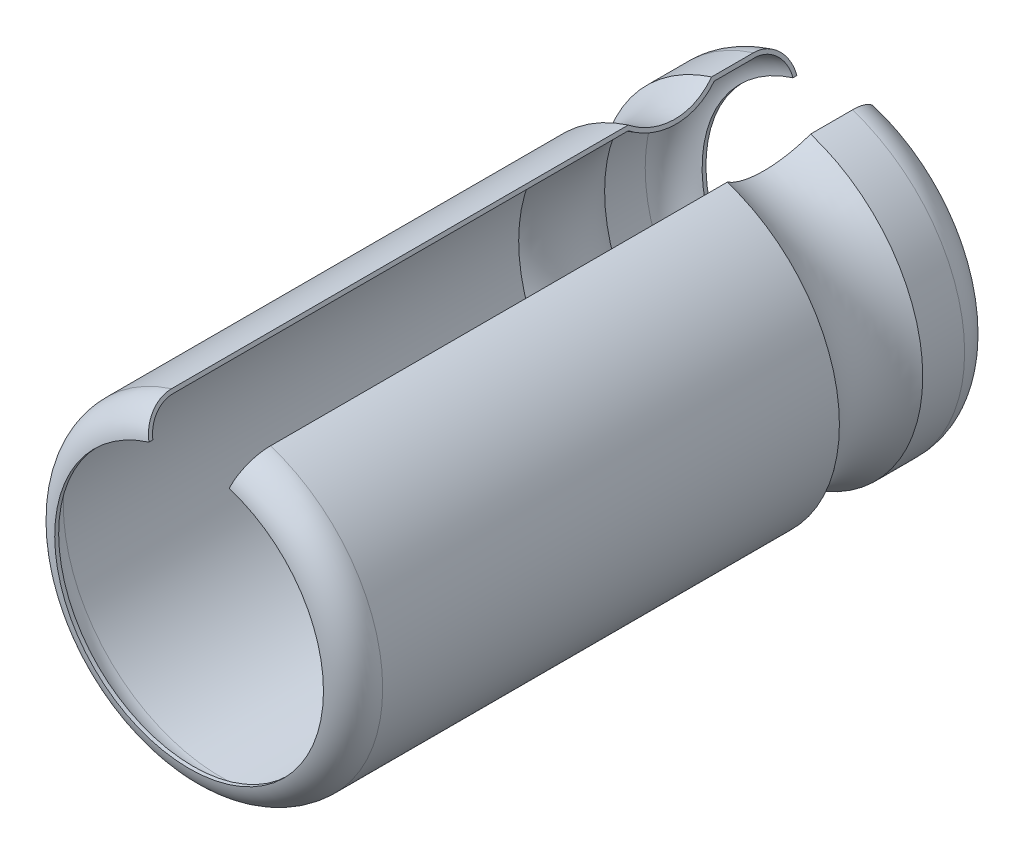
ISO-10303-21;
HEADER;
FILE_DESCRIPTION(('STEP AP214'),'2;1');
FILE_NAME('part.step','',(''),(''),'','','');
FILE_SCHEMA(('AUTOMOTIVE_DESIGN { 1 0 10303 214 1 1 1 1 }'));
ENDSEC;
DATA;
#1=APPLICATION_CONTEXT('core data for automotive mechanical design processes');
#2=APPLICATION_PROTOCOL_DEFINITION('international standard','automotive_design',2000,#1);
#3=PRODUCT_CONTEXT('',#1,'mechanical');
#4=PRODUCT('Part','Part','',(#3));
#5=PRODUCT_RELATED_PRODUCT_CATEGORY('part','',(#4));
#6=PRODUCT_DEFINITION_FORMATION('','',#4);
#7=PRODUCT_DEFINITION_CONTEXT('part definition',#1,'design');
#8=PRODUCT_DEFINITION('design','',#6,#7);
#9=PRODUCT_DEFINITION_SHAPE('','',#8);
#10=(LENGTH_UNIT() NAMED_UNIT(*) SI_UNIT(.MILLI.,.METRE.));
#11=(NAMED_UNIT(*) PLANE_ANGLE_UNIT() SI_UNIT($,.RADIAN.));
#12=(NAMED_UNIT(*) SI_UNIT($,.STERADIAN.) SOLID_ANGLE_UNIT());
#13=UNCERTAINTY_MEASURE_WITH_UNIT(LENGTH_MEASURE(1.E-05),#10,'distance_accuracy_value','');
#14=(GEOMETRIC_REPRESENTATION_CONTEXT(3) GLOBAL_UNCERTAINTY_ASSIGNED_CONTEXT((#13)) GLOBAL_UNIT_ASSIGNED_CONTEXT((#10,
#11,#12)) REPRESENTATION_CONTEXT('',''));
#15=CARTESIAN_POINT('',(0.,0.,0.));
#16=DIRECTION('',(0.,0.,1.));
#17=DIRECTION('',(1.,0.,0.));
#18=AXIS2_PLACEMENT_3D('',#15,#16,#17);
#19=CARTESIAN_POINT('',(-205.237767720353,-97.447783979241,-9.00000000000008));
#20=DIRECTION('',(0.,0.,-1.));
#21=DIRECTION('',(-1.,0.,0.));
#22=AXIS2_PLACEMENT_3D('',#19,#20,#21);
#23=TOROIDAL_SURFACE('',#22,3.9999999999999,0.880000000000012);
#24=CARTESIAN_POINT('',(-204.049411116396,-93.6283849974859,-9.88000000000009));
#25=CARTESIAN_POINT('',(-204.03245047556,-93.5817860197691,-9.88004198714158));
#26=CARTESIAN_POINT('',(-204.015493927163,-93.5351982859351,-9.8758202195455));
#27=CARTESIAN_POINT('',(-203.982072550367,-93.4433738078617,-9.8591561997904));
#28=CARTESIAN_POINT('',(-203.965607363847,-93.3981360796913,-9.84672009542887));
#29=CARTESIAN_POINT('',(-203.933617492738,-93.3102446311675,-9.81392539837095));
#30=CARTESIAN_POINT('',(-203.918093282006,-93.2675922127282,-9.79356285174915));
#31=CARTESIAN_POINT('',(-203.888438098273,-93.1861152650512,-9.74550819099352));
#32=CARTESIAN_POINT('',(-203.874306863684,-93.1472900171074,-9.71781745663625));
#33=CARTESIAN_POINT('',(-203.847845486058,-93.0745879795935,-9.65590540741109));
#34=CARTESIAN_POINT('',(-203.835514205508,-93.0407080647292,-9.62168824885637));
#35=CARTESIAN_POINT('',(-203.812991022079,-92.9788261268451,-9.54767389860997));
#36=CARTESIAN_POINT('',(-203.802799536708,-92.950825250916,-9.50787562047809));
#37=CARTESIAN_POINT('',(-203.784856280772,-92.9015265603998,-9.42386934338579));
#38=CARTESIAN_POINT('',(-203.777102849111,-92.8802241819899,-9.37966437395536));
#39=CARTESIAN_POINT('',(-203.764250272756,-92.8449120186709,-9.28808313164655));
#40=CARTESIAN_POINT('',(-203.759149542789,-92.8308978782655,-9.24070877196635));
#41=CARTESIAN_POINT('',(-203.753023696497,-92.8140672539013,-9.16086707367844));
#42=CARTESIAN_POINT('',(-203.751199330487,-92.8090548494851,-9.12890446727889));
#43=CARTESIAN_POINT('',(-203.748765551823,-92.8023680975612,-9.06463239991749));
#44=CARTESIAN_POINT('',(-203.748154414107,-92.8006890104878,-9.03232349720697));
#45=CARTESIAN_POINT('',(-203.748155797626,-92.800692811675,-9.00000000000009));
#46=B_SPLINE_CURVE_WITH_KNOTS('',3,(#24,#25,#26,#27,#28,#29,#30,#31,#32,#33,#34,#35,#36,#37,#38,
#39,#40,#41,#42,#43,#44,#45),.UNSPECIFIED.,.F.,.F.,(4,2,2,2,2,2,2,2,2,2,4),(0.,0.14857231243137,
0.297033555747823,0.445568950674934,0.594076398716195,0.742489584586696,0.890931701293249,
1.03927246112343,1.18752446943214,1.28455525229134,1.38144797025738),.UNSPECIFIED.);
#47=CARTESIAN_POINT('',(-204.049411116396,-93.6283849974859,-9.88000000000009));
#48=VERTEX_POINT('',#47);
#49=CARTESIAN_POINT('',(-203.748155797626,-92.800692811675,-9.00000000000009));
#50=VERTEX_POINT('',#49);
#51=EDGE_CURVE('E120',#48,#50,#46,.T.);
#52=ORIENTED_EDGE('',*,*,#51,.F.);
#53=CARTESIAN_POINT('',(-205.237767720353,-97.4477839792411,-9.88000000000009));
#54=DIRECTION('',(0.,0.,-1.));
#55=DIRECTION('',(-1.,0.,0.));
#56=AXIS2_PLACEMENT_3D('',#53,#54,#55);
#57=CIRCLE('',#56,4.00000000000003);
#58=CARTESIAN_POINT('',(-206.426124324694,-93.6283849976054,-9.88000000000009));
#59=VERTEX_POINT('',#58);
#60=EDGE_CURVE('E119',#48,#59,#57,.T.);
#61=ORIENTED_EDGE('',*,*,#60,.T.);
#62=CARTESIAN_POINT('',(-206.727379643462,-92.8006928117976,-9.0000000000001));
#63=CARTESIAN_POINT('',(-206.727394069039,-92.8006531778515,-9.04947868093799));
#64=CARTESIAN_POINT('',(-206.725952191707,-92.8046147032607,-9.09894461511821));
#65=CARTESIAN_POINT('',(-206.720262353567,-92.8202474050716,-9.19643807897552));
#66=CARTESIAN_POINT('',(-206.716016647702,-92.8319123860669,-9.24446673214794));
#67=CARTESIAN_POINT('',(-206.704822708036,-92.8626674825325,-9.33777874070551));
#68=CARTESIAN_POINT('',(-206.697873193657,-92.8817611163654,-9.3830607834753));
#69=CARTESIAN_POINT('',(-206.681475554512,-92.9268132596475,-9.46956518289869));
#70=CARTESIAN_POINT('',(-206.672027856966,-92.9527705953233,-9.510788232035));
#71=CARTESIAN_POINT('',(-206.650897903719,-93.0108246647429,-9.58802659272401));
#72=CARTESIAN_POINT('',(-206.6392150101,-93.0429231511553,-9.6240404124109));
#73=CARTESIAN_POINT('',(-206.613945826119,-93.1123496635517,-9.68983436577946));
#74=CARTESIAN_POINT('',(-206.600359163969,-93.1496787110133,-9.71961327900446));
#75=CARTESIAN_POINT('',(-206.571658589272,-93.2285328919193,-9.77211119200505));
#76=CARTESIAN_POINT('',(-206.556543281909,-93.2700618575878,-9.79482366555942));
#77=CARTESIAN_POINT('',(-206.52522674012,-93.3561033490081,-9.83250277302531));
#78=CARTESIAN_POINT('',(-206.509026129625,-93.4006141605258,-9.84747381497146));
#79=CARTESIAN_POINT('',(-206.481627387724,-93.4758915852201,-9.8655567164391));
#80=CARTESIAN_POINT('',(-206.470600456728,-93.5061878291372,-9.87096983662315));
#81=CARTESIAN_POINT('',(-206.448425312545,-93.5671135370525,-9.87819102038921));
#82=CARTESIAN_POINT('',(-206.437277294599,-93.5977424646308,-9.88000421070748));
#83=CARTESIAN_POINT('',(-206.426124324694,-93.6283849976054,-9.88000000000009));
#84=B_SPLINE_CURVE_WITH_KNOTS('',3,(#62,#63,#64,#65,#66,#67,#68,#69,#70,#71,#72,#73,#74,#75,#76,
#77,#78,#79,#80,#81,#82,#83),.UNSPECIFIED.,.F.,.F.,(4,2,2,2,2,2,2,2,2,2,4),(0.,
0.148238465777582,0.296357857603846,0.444547487387526,0.592711791383805,0.740918444341886,
0.889154081061064,1.0375262174085,1.18581377615464,1.28370199685205,1.38145071258297),.UNSPECIFIED.);
#85=CARTESIAN_POINT('',(-206.727379643462,-92.8006928117976,-9.0000000000001));
#86=VERTEX_POINT('',#85);
#87=EDGE_CURVE('E30',#86,#59,#84,.T.);
#88=ORIENTED_EDGE('',*,*,#87,.F.);
#89=CARTESIAN_POINT('',(-205.237767720353,-97.4477839792411,-9.0000000000001));
#90=DIRECTION('',(0.,0.,1.));
#91=DIRECTION('',(1.,0.,0.));
#92=AXIS2_PLACEMENT_3D('',#89,#90,#91);
#93=CIRCLE('',#92,4.88000000000005);
#94=EDGE_CURVE('E111',#86,#50,#93,.T.);
#95=ORIENTED_EDGE('',*,*,#94,.T.);
#96=EDGE_LOOP('',(#52,#61,#88,#95));
#97=FACE_BOUND('',#96,.T.);
#98=ADVANCED_FACE('F25',(#97),#23,.F.);
#99=CARTESIAN_POINT('',(-205.237767720353,-97.4477839792411,-10.0000000000001));
#100=DIRECTION('',(0.,0.,-1.));
#101=DIRECTION('',(-1.,0.,0.));
#102=AXIS2_PLACEMENT_3D('',#99,#100,#101);
#103=CYLINDRICAL_SURFACE('',#102,4.00000000000003);
#104=ORIENTED_EDGE('',*,*,#60,.F.);
#105=DIRECTION('',(0.,0.,-1.));
#106=VECTOR('',#105,1.);
#107=CARTESIAN_POINT('',(-204.049411116396,-93.628384997486,-10.0000000000001));
#108=LINE('',#107,#106);
#109=CARTESIAN_POINT('',(-204.049411116396,-93.6283849974859,-10.0000000000001));
#110=VERTEX_POINT('',#109);
#111=EDGE_CURVE('E136',#110,#48,#108,.F.);
#112=ORIENTED_EDGE('',*,*,#111,.F.);
#113=CARTESIAN_POINT('',(-205.237767720353,-97.4477839792411,-10.0000000000001));
#114=DIRECTION('',(0.,0.,1.));
#115=DIRECTION('',(1.,0.,0.));
#116=AXIS2_PLACEMENT_3D('',#113,#114,#115);
#117=CIRCLE('',#116,4.00000000000003);
#118=CARTESIAN_POINT('',(-206.426124324694,-93.6283849976054,-10.0000000000001));
#119=VERTEX_POINT('',#118);
#120=EDGE_CURVE('E212',#119,#110,#117,.T.);
#121=ORIENTED_EDGE('',*,*,#120,.F.);
#122=DIRECTION('',(0.,0.,-1.));
#123=VECTOR('',#122,1.);
#124=CARTESIAN_POINT('',(-206.426124324694,-93.6283849976054,-10.0000000000001));
#125=LINE('',#124,#123);
#126=EDGE_CURVE('E131',#59,#119,#125,.T.);
#127=ORIENTED_EDGE('',*,*,#126,.F.);
#128=EDGE_LOOP('',(#104,#112,#121,#127));
#129=FACE_BOUND('',#128,.T.);
#130=ADVANCED_FACE('F225',(#129),#103,.F.);
#131=CARTESIAN_POINT('',(-205.237767720353,-97.4477839792411,-8.35236999988217));
#132=DIRECTION('',(0.,0.,1.));
#133=DIRECTION('',(1.,0.,0.));
#134=AXIS2_PLACEMENT_3D('',#131,#132,#133);
#135=CYLINDRICAL_SURFACE('',#134,4.88000000000005);
#136=ORIENTED_EDGE('',*,*,#94,.F.);
#137=DIRECTION('',(0.,0.,1.));
#138=VECTOR('',#137,1.);
#139=CARTESIAN_POINT('',(-206.727379643462,-92.8006928117975,-8.35236999988217));
#140=LINE('',#139,#138);
#141=CARTESIAN_POINT('',(-206.727379643462,-92.8006928117975,-7.74504137363977));
#142=VERTEX_POINT('',#141);
#143=EDGE_CURVE('E99',#142,#86,#140,.F.);
#144=ORIENTED_EDGE('',*,*,#143,.F.);
#145=CARTESIAN_POINT('',(-205.237767720353,-97.4477839792411,-7.74504137363979));
#146=DIRECTION('',(0.,0.,-1.));
#147=DIRECTION('',(-1.,0.,0.));
#148=AXIS2_PLACEMENT_3D('',#145,#146,#147);
#149=CIRCLE('',#148,4.88000000000008);
#150=CARTESIAN_POINT('',(-203.748155797626,-92.800692811675,-7.74504137363977));
#151=VERTEX_POINT('',#150);
#152=EDGE_CURVE('E239',#151,#142,#149,.T.);
#153=ORIENTED_EDGE('',*,*,#152,.F.);
#154=DIRECTION('',(0.,0.,1.));
#155=VECTOR('',#154,1.);
#156=CARTESIAN_POINT('',(-203.748155797626,-92.800692811675,-8.35236999988217));
#157=LINE('',#156,#155);
#158=EDGE_CURVE('E112',#50,#151,#157,.T.);
#159=ORIENTED_EDGE('',*,*,#158,.F.);
#160=EDGE_LOOP('',(#136,#144,#153,#159));
#161=FACE_BOUND('',#160,.T.);
#162=ADVANCED_FACE('F122',(#161),#135,.F.);
#163=CARTESIAN_POINT('',(-205.237767720353,-97.4477839792411,-9.00000000000008));
#164=DIRECTION('',(0.,0.,-1.));
#165=DIRECTION('',(-1.,0.,0.));
#166=AXIS2_PLACEMENT_3D('',#163,#164,#165);
#167=TOROIDAL_SURFACE('',#166,4.0000000000001,1.);
#168=CARTESIAN_POINT('',(-206.768452334568,-92.6878465204285,-9.0000000000001));
#169=CARTESIAN_POINT('',(-206.768452273509,-92.6878466881845,-9.02811912623945));
#170=CARTESIAN_POINT('',(-206.768046142166,-92.6889625248804,-9.05622477709785));
#171=CARTESIAN_POINT('',(-206.766425939005,-92.6934139964801,-9.11223486527839));
#172=CARTESIAN_POINT('',(-206.765211906891,-92.6967495223004,-9.1401393124203));
#173=CARTESIAN_POINT('',(-206.760369585755,-92.7100536902793,-9.22320123051986));
#174=CARTESIAN_POINT('',(-206.755541039402,-92.7233200123518,-9.27780216606445));
#175=CARTESIAN_POINT('',(-206.742817617801,-92.7582773258991,-9.38385708626218));
#176=CARTESIAN_POINT('',(-206.734921288312,-92.7799723128663,-9.43530956502344));
#177=CARTESIAN_POINT('',(-206.71628787774,-92.8311671876609,-9.53360833823916));
#178=CARTESIAN_POINT('',(-206.705551283272,-92.8606657385239,-9.58045541984041));
#179=CARTESIAN_POINT('',(-206.681539238846,-92.9266382883777,-9.66822852556382));
#180=CARTESIAN_POINT('',(-206.668263110831,-92.9631141503169,-9.7091529631968));
#181=CARTESIAN_POINT('',(-206.639547739089,-93.0420089857708,-9.78391825499171));
#182=CARTESIAN_POINT('',(-206.62410807338,-93.0844291186694,-9.81775772406648));
#183=CARTESIAN_POINT('',(-206.591493767759,-93.1740361869142,-9.87741232798034));
#184=CARTESIAN_POINT('',(-206.574317602206,-93.2212273139242,-9.90322032397899));
#185=CARTESIAN_POINT('',(-206.538731324792,-93.3189998075639,-9.94603428470633));
#186=CARTESIAN_POINT('',(-206.520321921859,-93.3695792264278,-9.96304525819989));
#187=CARTESIAN_POINT('',(-206.489188778214,-93.4551168355889,-9.98359078838005));
#188=CARTESIAN_POINT('',(-206.476659584021,-93.4895405137175,-9.98974073094198));
#189=CARTESIAN_POINT('',(-206.451463428407,-93.5587663823229,-9.99794481530676));
#190=CARTESIAN_POINT('',(-206.438796688866,-93.5935679631901,-10.0000047839443));
#191=CARTESIAN_POINT('',(-206.426124324694,-93.6283849976054,-10.0000000000001));
#192=B_SPLINE_CURVE_WITH_KNOTS('',3,(#168,#169,#170,#171,#172,#173,#174,#175,#176,#177,#178,
#179,#180,#181,#182,#183,#184,#185,#186,#187,#188,#189,#190,#191),.UNSPECIFIED.,.F.,.F.,(4,2,2,
2,2,2,2,2,2,2,2,4),(0.,0.0843055496861419,0.168606956599925,0.3369287308891,0.505330393343309,
0.673703222640448,0.842121070548099,1.01057181288988,1.17917185919156,1.3476758036191,
1.4588996373555,1.56996490057831),.UNSPECIFIED.);
#193=CARTESIAN_POINT('',(-206.768452334568,-92.6878465204285,-9.00000000000011));
#194=VERTEX_POINT('',#193);
#195=EDGE_CURVE('E127',#194,#119,#192,.T.);
#196=ORIENTED_EDGE('',*,*,#195,.T.);
#197=ORIENTED_EDGE('',*,*,#120,.T.);
#198=CARTESIAN_POINT('',(-204.049411116396,-93.6283849974859,-10.0000000000001));
#199=CARTESIAN_POINT('',(-204.039772740314,-93.60190377684,-9.99999979978598));
#200=CARTESIAN_POINT('',(-204.030138970638,-93.5754352121909,-9.9988107007362));
#201=CARTESIAN_POINT('',(-204.010940263484,-93.5226871978029,-9.99406647109336));
#202=CARTESIAN_POINT('',(-204.001375323007,-93.4964077398236,-9.99051144423477));
#203=CARTESIAN_POINT('',(-203.972902561398,-93.4181794702337,-9.97633023587498));
#204=CARTESIAN_POINT('',(-203.954185311377,-93.3667542484461,-9.9621878380735));
#205=CARTESIAN_POINT('',(-203.91782888953,-93.2668658003683,-9.92491442394905));
#206=CARTESIAN_POINT('',(-203.900190261783,-93.2184040689238,-9.90177891389895));
#207=CARTESIAN_POINT('',(-203.866493692709,-93.1258235062816,-9.84717522815655));
#208=CARTESIAN_POINT('',(-203.850435454229,-93.0817038586596,-9.81570862304815));
#209=CARTESIAN_POINT('',(-203.820366457904,-92.9990899702312,-9.7453559192308));
#210=CARTESIAN_POINT('',(-203.80635438475,-92.960592115642,-9.70647462421047));
#211=CARTESIAN_POINT('',(-203.780761002975,-92.8902748771261,-9.62237123378909));
#212=CARTESIAN_POINT('',(-203.769180169126,-92.8584567976281,-9.5771479027838));
#213=CARTESIAN_POINT('',(-203.748790466748,-92.8024365507554,-9.48168952421367));
#214=CARTESIAN_POINT('',(-203.73997977534,-92.7782293750626,-9.43145780118582));
#215=CARTESIAN_POINT('',(-203.72537443056,-92.7381015200766,-9.32739067111309));
#216=CARTESIAN_POINT('',(-203.71957797716,-92.7221758952473,-9.27355743653198));
#217=CARTESIAN_POINT('',(-203.71261594191,-92.7030478606036,-9.18282531094787));
#218=CARTESIAN_POINT('',(-203.710542374108,-92.6973507798908,-9.14649987615732));
#219=CARTESIAN_POINT('',(-203.70777615071,-92.6897506435659,-9.07345473241963));
#220=CARTESIAN_POINT('',(-203.70708153432,-92.6878422007209,-9.0367356580641));
#221=CARTESIAN_POINT('',(-203.70708310652,-92.6878465203056,-9.00000000000009));
#222=B_SPLINE_CURVE_WITH_KNOTS('',3,(#198,#199,#200,#201,#202,#203,#204,#205,#206,#207,#208,
#209,#210,#211,#212,#213,#214,#215,#216,#217,#218,#219,#220,#221),.UNSPECIFIED.,.F.,.F.,(4,2,2,
2,2,2,2,2,2,2,2,4),(0.,0.0844903275211752,0.168976950794573,0.337677509779566,0.506462474562859,
0.675215642514704,0.843859851018706,1.01253696184966,1.18110284208379,1.34956794303389,
1.45984344185022,1.56996202238542),.UNSPECIFIED.);
#223=CARTESIAN_POINT('',(-203.70708310652,-92.6878465203056,-9.00000000000009));
#224=VERTEX_POINT('',#223);
#225=EDGE_CURVE('E124',#110,#224,#222,.T.);
#226=ORIENTED_EDGE('',*,*,#225,.T.);
#227=CARTESIAN_POINT('',(-205.237767720353,-97.4477839792411,-9.00000000000011));
#228=DIRECTION('',(0.,0.,1.));
#229=DIRECTION('',(1.,0.,0.));
#230=AXIS2_PLACEMENT_3D('',#227,#228,#229);
#231=CIRCLE('',#230,5.00000000000003);
#232=EDGE_CURVE('E242',#194,#224,#231,.T.);
#233=ORIENTED_EDGE('',*,*,#232,.F.);
#234=EDGE_LOOP('',(#196,#197,#226,#233));
#235=FACE_BOUND('',#234,.T.);
#236=ADVANCED_FACE('F216',(#235),#167,.T.);
#237=CARTESIAN_POINT('',(-205.237767720353,-97.4477839792411,1.93657000024675));
#238=DIRECTION('',(0.,0.,1.));
#239=DIRECTION('',(1.,0.,0.));
#240=AXIS2_PLACEMENT_3D('',#237,#238,#239);
#241=CYLINDRICAL_SURFACE('',#240,4.88000000000002);
#242=CARTESIAN_POINT('',(-205.237767720353,-97.4477839792411,-5.08655862563087));
#243=DIRECTION('',(0.,0.,1.));
#244=DIRECTION('',(1.,0.,0.));
#245=AXIS2_PLACEMENT_3D('',#242,#243,#244);
#246=CIRCLE('',#245,4.88000000000004);
#247=CARTESIAN_POINT('',(-206.727379643462,-92.8006928117976,-5.08655862563087));
#248=VERTEX_POINT('',#247);
#249=CARTESIAN_POINT('',(-203.748155797626,-92.800692811675,-5.08655862563089));
#250=VERTEX_POINT('',#249);
#251=EDGE_CURVE('E248',#248,#250,#246,.T.);
#252=ORIENTED_EDGE('',*,*,#251,.F.);
#253=DIRECTION('',(0.,0.,1.));
#254=VECTOR('',#253,1.);
#255=CARTESIAN_POINT('',(-206.727379643462,-92.8006928117976,-0.00616074521099108));
#256=LINE('',#255,#254);
#257=CARTESIAN_POINT('',(-206.727379643462,-92.8006928117975,8.99999999999991));
#258=VERTEX_POINT('',#257);
#259=EDGE_CURVE('E185',#248,#258,#256,.T.);
#260=ORIENTED_EDGE('',*,*,#259,.T.);
#261=CARTESIAN_POINT('',(-205.237767720353,-97.4477839792409,8.99999999999991));
#262=DIRECTION('',(0.,0.,1.));
#263=DIRECTION('',(1.,0.,0.));
#264=AXIS2_PLACEMENT_3D('',#261,#262,#263);
#265=CIRCLE('',#264,4.88000000000004);
#266=CARTESIAN_POINT('',(-203.748155797626,-92.8006928116749,8.99999999999991));
#267=VERTEX_POINT('',#266);
#268=EDGE_CURVE('E244',#258,#267,#265,.T.);
#269=ORIENTED_EDGE('',*,*,#268,.T.);
#270=DIRECTION('',(0.,0.,1.));
#271=VECTOR('',#270,1.);
#272=CARTESIAN_POINT('',(-203.748155797626,-92.800692811675,-0.00616074521099108));
#273=LINE('',#272,#271);
#274=EDGE_CURVE('E275',#267,#250,#273,.F.);
#275=ORIENTED_EDGE('',*,*,#274,.T.);
#276=EDGE_LOOP('',(#252,#260,#269,#275));
#277=FACE_BOUND('',#276,.T.);
#278=ADVANCED_FACE('F219',(#277),#241,.F.);
#279=CARTESIAN_POINT('',(-205.237767720353,-97.4477839792411,-6.41579999963531));
#280=DIRECTION('',(0.,0.,-1.));
#281=DIRECTION('',(-1.,0.,0.));
#282=AXIS2_PLACEMENT_3D('',#279,#280,#281);
#283=TOROIDAL_SURFACE('',#282,6.66958809878961,2.22923937559309);
#284=CARTESIAN_POINT('',(-206.727379643462,-92.8006928117975,-7.74504137363977));
#285=CARTESIAN_POINT('',(-206.714589027586,-92.8358347400968,-7.69472986076202));
#286=CARTESIAN_POINT('',(-206.702530390473,-92.8689655732757,-7.64286484368701));
#287=CARTESIAN_POINT('',(-206.679949044738,-92.9310073107822,-7.53635436022455));
#288=CARTESIAN_POINT('',(-206.66942627042,-92.9599183956124,-7.48170901290253));
#289=CARTESIAN_POINT('',(-206.640295465663,-93.0399546238922,-7.31424270351903));
#290=CARTESIAN_POINT('',(-206.624088594508,-93.0844826364314,-7.1977481792758));
#291=CARTESIAN_POINT('',(-206.598597388304,-93.1545191498701,-6.95846527443557));
#292=CARTESIAN_POINT('',(-206.589316026938,-93.1800194806473,-6.83567421438296));
#293=CARTESIAN_POINT('',(-206.577939774478,-93.2112754773988,-6.58729367631366));
#294=CARTESIAN_POINT('',(-206.575842970574,-93.2170363987784,-6.46170495210874));
#295=CARTESIAN_POINT('',(-206.578892832657,-93.2086569715729,-6.21133329968975));
#296=CARTESIAN_POINT('',(-206.584037168591,-93.1945230247547,-6.08655012524387));
#297=CARTESIAN_POINT('',(-206.601421279755,-93.1467605718753,-5.84125680087936));
#298=CARTESIAN_POINT('',(-206.613660908947,-93.1131324670475,-5.72074656306826));
#299=CARTESIAN_POINT('',(-206.641601330694,-93.0363667892062,-5.51195058439034));
#300=CARTESIAN_POINT('',(-206.656040717903,-92.996694898899,-5.42220110407319));
#301=CARTESIAN_POINT('',(-206.688839161318,-92.9065819162221,-5.24918103604665));
#302=CARTESIAN_POINT('',(-206.707193843706,-92.8561528408214,-5.16590335909065));
#303=CARTESIAN_POINT('',(-206.727379643462,-92.8006928117976,-5.08655862563092));
#304=B_SPLINE_CURVE_WITH_KNOTS('',3,(#284,#285,#286,#287,#288,#289,#290,#291,#292,#293,#294,
#295,#296,#297,#298,#299,#300,#301,#302,#303),.UNSPECIFIED.,.F.,.F.,(4,2,2,2,2,2,2,2,2,4),(0.,
0.187949084444141,0.375890126881717,0.751243753878256,1.12675845794068,1.50217317748382,
1.87746712376034,2.252753345918,2.54945681523381,2.8458305536007),.UNSPECIFIED.);
#305=EDGE_CURVE('E106',#142,#248,#304,.T.);
#306=ORIENTED_EDGE('',*,*,#305,.T.);
#307=ORIENTED_EDGE('',*,*,#251,.T.);
#308=CARTESIAN_POINT('',(-203.748155797626,-92.800692811675,-5.08655862563087));
#309=CARTESIAN_POINT('',(-203.760946413502,-92.8358347399743,-5.13687013850847));
#310=CARTESIAN_POINT('',(-203.773005050615,-92.8689655731532,-5.18873515558333));
#311=CARTESIAN_POINT('',(-203.79558639635,-92.9310073106597,-5.29524563904551));
#312=CARTESIAN_POINT('',(-203.806109170669,-92.95991839549,-5.34989098636739));
#313=CARTESIAN_POINT('',(-203.835239975425,-93.03995462377,-5.51735729575046));
#314=CARTESIAN_POINT('',(-203.851446846581,-93.0844826363093,-5.63385181999344));
#315=CARTESIAN_POINT('',(-203.876938052784,-93.1545191497483,-5.87313472483318));
#316=CARTESIAN_POINT('',(-203.886219414151,-93.1800194805256,-5.99592578488557));
#317=CARTESIAN_POINT('',(-203.897595666611,-93.2112754772775,-6.24430632295446));
#318=CARTESIAN_POINT('',(-203.899692470515,-93.2170363986572,-6.36989504715918));
#319=CARTESIAN_POINT('',(-203.896642608432,-93.2086569714519,-6.62026669957756));
#320=CARTESIAN_POINT('',(-203.891498272498,-93.194523024634,-6.74504987402303));
#321=CARTESIAN_POINT('',(-203.874114161335,-93.1467605717549,-6.99034319838675));
#322=CARTESIAN_POINT('',(-203.861874532143,-93.1131324669274,-7.11085343619748));
#323=CARTESIAN_POINT('',(-203.833934110395,-93.0363667890862,-7.31964941487607));
#324=CARTESIAN_POINT('',(-203.819494723186,-92.9966948987786,-7.40939889519418));
#325=CARTESIAN_POINT('',(-203.78669627977,-92.9065819161007,-7.5824189632225));
#326=CARTESIAN_POINT('',(-203.768341597383,-92.8561528406995,-7.66569664017932));
#327=CARTESIAN_POINT('',(-203.748155797626,-92.800692811675,-7.74504137363978));
#328=B_SPLINE_CURVE_WITH_KNOTS('',3,(#308,#309,#310,#311,#312,#313,#314,#315,#316,#317,#318,
#319,#320,#321,#322,#323,#324,#325,#326,#327),.UNSPECIFIED.,.F.,.F.,(4,2,2,2,2,2,2,2,2,4),(0.,
0.187949084443827,0.375890126881097,0.751243753877069,1.12675845793896,1.50217317748153,
1.87746712375676,2.25275334591314,2.54945681523204,2.84583055360201),.UNSPECIFIED.);
#329=EDGE_CURVE('E278',#250,#151,#328,.T.);
#330=ORIENTED_EDGE('',*,*,#329,.T.);
#331=ORIENTED_EDGE('',*,*,#152,.T.);
#332=EDGE_LOOP('',(#306,#307,#330,#331));
#333=FACE_BOUND('',#332,.T.);
#334=ADVANCED_FACE('F167',(#333),#283,.T.);
#335=CARTESIAN_POINT('',(-205.237767720353,-97.4477839792409,8.99999999999988));
#336=DIRECTION('',(0.,0.,-1.));
#337=DIRECTION('',(-1.,0.,0.));
#338=AXIS2_PLACEMENT_3D('',#335,#336,#337);
#339=TOROIDAL_SURFACE('',#338,3.99999999999986,0.880000000000019);
#340=ORIENTED_EDGE('',*,*,#268,.F.);
#341=CARTESIAN_POINT('',(-206.727379643462,-92.8006928117976,8.9999999999999));
#342=CARTESIAN_POINT('',(-206.727394070107,-92.8006531749176,9.04947584533887));
#343=CARTESIAN_POINT('',(-206.725952357192,-92.8046142485957,9.09893895902596));
#344=CARTESIAN_POINT('',(-206.720262837207,-92.8202460762806,9.19643258678916));
#345=CARTESIAN_POINT('',(-206.716016965373,-92.8319115132707,9.24446406500525));
#346=CARTESIAN_POINT('',(-206.70482230076,-92.8626686015149,9.33778215479434));
#347=CARTESIAN_POINT('',(-206.697872184073,-92.8817638901752,9.3830674093375));
#348=CARTESIAN_POINT('',(-206.681474162452,-92.9268170843008,9.46957122756189));
#349=CARTESIAN_POINT('',(-206.672027049556,-92.9527728136626,9.51079107509051));
#350=CARTESIAN_POINT('',(-206.650900499395,-93.0108175331802,9.58801721285546));
#351=CARTESIAN_POINT('',(-206.639220802092,-93.0429072377864,9.62402289491609));
#352=CARTESIAN_POINT('',(-206.613952316681,-93.112331830879,9.68981990212306));
#353=CARTESIAN_POINT('',(-206.60036223555,-93.149670271914,9.71960698406074));
#354=CARTESIAN_POINT('',(-206.571646452364,-93.2285662377998,9.77213406992266));
#355=CARTESIAN_POINT('',(-206.556518399006,-93.2701302228017,9.79486306143133));
#356=CARTESIAN_POINT('',(-206.525196720649,-93.356185826828,9.83252944244749));
#357=CARTESIAN_POINT('',(-206.509005643324,-93.4006704461733,9.84748474636291));
#358=CARTESIAN_POINT('',(-206.488268495819,-93.4576452906866,9.86117431829058));
#359=CARTESIAN_POINT('',(-206.483995416888,-93.4693854785627,9.86371105059154));
#360=CARTESIAN_POINT('',(-206.479707260074,-93.4811670925787,9.8659727699428));
#361=B_SPLINE_CURVE_WITH_KNOTS('',3,(#341,#342,#343,#344,#345,#346,#347,#348,#349,#350,#351,
#352,#353,#354,#355,#356,#357,#358,#359,#360),.UNSPECIFIED.,.F.,.F.,(4,2,2,2,2,2,2,2,2,4),(0.,
0.148230024490025,0.296357857653258,0.444558300662766,0.592711791399056,0.740882548734658,
0.889154081038349,1.03765580557008,1.18581377451592,1.22404616169141),.UNSPECIFIED.);
#362=CARTESIAN_POINT('',(-206.479707260074,-93.4811670925786,9.8659727699428));
#363=VERTEX_POINT('',#362);
#364=EDGE_CURVE('E179',#258,#363,#361,.T.);
#365=ORIENTED_EDGE('',*,*,#364,.T.);
#366=CARTESIAN_POINT('',(-205.237767720353,-97.447783979241,9.8659727699428));
#367=DIRECTION('',(0.,0.,1.));
#368=DIRECTION('',(1.,0.,0.));
#369=AXIS2_PLACEMENT_3D('',#366,#367,#368);
#370=CIRCLE('',#369,4.15649652302016);
#371=CARTESIAN_POINT('',(-203.995828181015,-93.4811670924585,9.8659727699428));
#372=VERTEX_POINT('',#371);
#373=EDGE_CURVE('E259',#363,#372,#370,.T.);
#374=ORIENTED_EDGE('',*,*,#373,.T.);
#375=CARTESIAN_POINT('',(-203.995828181015,-93.4811670924585,9.86597276994281));
#376=CARTESIAN_POINT('',(-203.979143352826,-93.4353259037624,9.85720871225636));
#377=CARTESIAN_POINT('',(-203.962721422049,-93.390207019767,9.8442535039854));
#378=CARTESIAN_POINT('',(-203.930858497836,-93.3026643549757,9.81051137663538));
#379=CARTESIAN_POINT('',(-203.915416890449,-93.2602388873599,9.78972941694222));
#380=CARTESIAN_POINT('',(-203.885939883382,-93.1792514760488,9.74085925759146));
#381=CARTESIAN_POINT('',(-203.871905216773,-93.14069154645,9.71276727625432));
#382=CARTESIAN_POINT('',(-203.845653814404,-93.0685664112146,9.65010037764258));
#383=CARTESIAN_POINT('',(-203.833436470123,-93.0349995336762,9.61552763922528));
#384=CARTESIAN_POINT('',(-203.811171999376,-92.973828403041,9.54090227509843));
#385=CARTESIAN_POINT('',(-203.801123064396,-92.9462191810956,9.50085426182009));
#386=CARTESIAN_POINT('',(-203.783462626414,-92.8976975265207,9.41636082225205));
#387=CARTESIAN_POINT('',(-203.775852790525,-92.8767896742508,9.37191241535557));
#388=CARTESIAN_POINT('',(-203.763296715962,-92.8422921429132,9.27991430948141));
#389=CARTESIAN_POINT('',(-203.758350603472,-92.8287028105317,9.23236446370484));
#390=CARTESIAN_POINT('',(-203.751273234695,-92.8092578996266,9.135589779143));
#391=CARTESIAN_POINT('',(-203.749135402266,-92.8033842533023,9.08636913139571));
#392=CARTESIAN_POINT('',(-203.748244365419,-92.8009361496852,9.02469408742659));
#393=CARTESIAN_POINT('',(-203.748155255237,-92.8006913214718,9.01234444610268));
#394=CARTESIAN_POINT('',(-203.748155797626,-92.800692811675,8.99999999999991));
#395=B_SPLINE_CURVE_WITH_KNOTS('',3,(#375,#376,#377,#378,#379,#380,#381,#382,#383,#384,#385,
#386,#387,#388,#389,#390,#391,#392,#393,#394),.UNSPECIFIED.,.F.,.F.,(4,2,2,2,2,2,2,2,2,4),(0.,
0.148496298016918,0.296898659902203,0.445377947657396,0.593807405305479,0.742112586088194,
0.890518917779803,1.03893227901996,1.18699747787582,1.22404243074546),.UNSPECIFIED.);
#396=EDGE_CURVE('E173',#372,#267,#395,.T.);
#397=ORIENTED_EDGE('',*,*,#396,.T.);
#398=EDGE_LOOP('',(#340,#365,#374,#397));
#399=FACE_BOUND('',#398,.T.);
#400=ADVANCED_FACE('F161',(#399),#339,.F.);
#401=CARTESIAN_POINT('',(-205.237767720353,-97.4477839792411,-8.35236999988217));
#402=DIRECTION('',(0.,0.,1.));
#403=DIRECTION('',(1.,0.,0.));
#404=AXIS2_PLACEMENT_3D('',#401,#402,#403);
#405=CYLINDRICAL_SURFACE('',#404,5.00000000000003);
#406=CARTESIAN_POINT('',(-205.237767720353,-97.4477839792409,-7.70473999976436));
#407=DIRECTION('',(0.,0.,-1.));
#408=DIRECTION('',(-1.,0.,0.));
#409=AXIS2_PLACEMENT_3D('',#406,#407,#408);
#410=CIRCLE('',#409,5.00000000000014);
#411=CARTESIAN_POINT('',(-203.70708310652,-92.6878465203055,-7.70473999976433));
#412=VERTEX_POINT('',#411);
#413=CARTESIAN_POINT('',(-206.768452334568,-92.6878465204284,-7.70473999976431));
#414=VERTEX_POINT('',#413);
#415=EDGE_CURVE('E281',#412,#414,#410,.T.);
#416=ORIENTED_EDGE('',*,*,#415,.T.);
#417=DIRECTION('',(0.,0.,1.));
#418=VECTOR('',#417,1.);
#419=CARTESIAN_POINT('',(-206.768452334568,-92.6878465204285,-0.00616074521099108));
#420=LINE('',#419,#418);
#421=EDGE_CURVE('E264',#414,#194,#420,.F.);
#422=ORIENTED_EDGE('',*,*,#421,.T.);
#423=ORIENTED_EDGE('',*,*,#232,.T.);
#424=DIRECTION('',(0.,0.,1.));
#425=VECTOR('',#424,1.);
#426=CARTESIAN_POINT('',(-203.70708310652,-92.6878465203055,-0.00616074521099108));
#427=LINE('',#426,#425);
#428=EDGE_CURVE('E184',#224,#412,#427,.T.);
#429=ORIENTED_EDGE('',*,*,#428,.T.);
#430=EDGE_LOOP('',(#416,#422,#423,#429));
#431=FACE_BOUND('',#430,.T.);
#432=ADVANCED_FACE('F166',(#431),#405,.T.);
#433=CARTESIAN_POINT('',(-205.321863559437,-96.6623165153439,-0.00616074521099108));
#434=DIRECTION('',(-0.939692620786116,-0.342020143325099,0.));
#435=DIRECTION('',(0.342020143325099,-0.939692620786116,0.));
#436=AXIS2_PLACEMENT_3D('',#433,#434,#435);
#437=PLANE('',#436);
#438=ORIENTED_EDGE('',*,*,#259,.F.);
#439=ORIENTED_EDGE('',*,*,#305,.F.);
#440=ORIENTED_EDGE('',*,*,#143,.T.);
#441=ORIENTED_EDGE('',*,*,#87,.T.);
#442=ORIENTED_EDGE('',*,*,#126,.T.);
#443=ORIENTED_EDGE('',*,*,#195,.F.);
#444=ORIENTED_EDGE('',*,*,#421,.F.);
#445=CARTESIAN_POINT('',(-206.768452334568,-92.6878465204285,-7.70473999976432));
#446=CARTESIAN_POINT('',(-206.756049785506,-92.7219222439177,-7.65780145765292));
#447=CARTESIAN_POINT('',(-206.744330367438,-92.7541210804288,-7.60935565574068));
#448=CARTESIAN_POINT('',(-206.722327818431,-92.8145725869974,-7.50975483391682));
#449=CARTESIAN_POINT('',(-206.712044625667,-92.8428254269154,-7.45859993075277));
#450=CARTESIAN_POINT('',(-206.683478378978,-92.9213105446531,-7.30166320459372));
#451=CARTESIAN_POINT('',(-206.667445129208,-92.9653615363562,-7.19228223391362));
#452=CARTESIAN_POINT('',(-206.641890294034,-93.0355728689558,-6.96720915363187));
#453=CARTESIAN_POINT('',(-206.632371527986,-93.0617254637321,-6.85151433486282));
#454=CARTESIAN_POINT('',(-206.620116580579,-93.0953956550097,-6.61711880497607));
#455=CARTESIAN_POINT('',(-206.617378068459,-93.1029196552221,-6.49841914097403));
#456=CARTESIAN_POINT('',(-206.618759018114,-93.0991255272297,-6.26141125374876));
#457=CARTESIAN_POINT('',(-206.622875823403,-93.0878146976578,-6.14310289669055));
#458=CARTESIAN_POINT('',(-206.637844642826,-93.0466882042972,-5.91016003559912));
#459=CARTESIAN_POINT('',(-206.648698090453,-93.0168686020173,-5.79552631895578));
#460=CARTESIAN_POINT('',(-206.675429197306,-92.9434254895416,-5.58430880394255));
#461=CARTESIAN_POINT('',(-206.690697133277,-92.9014771802194,-5.48706551873171));
#462=CARTESIAN_POINT('',(-206.717215783521,-92.8286177874804,-5.34717931080221));
#463=CARTESIAN_POINT('',(-206.726659570271,-92.8026711966304,-5.3015415495381));
#464=CARTESIAN_POINT('',(-206.746702404661,-92.7476039617208,-5.21248177477643));
#465=CARTESIAN_POINT('',(-206.757301574798,-92.718482981106,-5.16905999693966));
#466=CARTESIAN_POINT('',(-206.768452334568,-92.6878465204286,-5.12685999950638));
#467=B_SPLINE_CURVE_WITH_KNOTS('',3,(#445,#446,#447,#448,#449,#450,#451,#452,#453,#454,#455,
#456,#457,#458,#459,#460,#461,#462,#463,#464,#465,#466),.UNSPECIFIED.,.F.,.F.,(4,2,2,2,2,2,2,2,
2,2,4),(0.,0.177834246448603,0.355660835431846,0.710838532288062,1.0661698469384,
1.42137899696382,1.77645053290208,2.13159765061021,2.45129090379818,2.61117861541764,
2.77108329515963),.UNSPECIFIED.);
#468=CARTESIAN_POINT('',(-206.768452334568,-92.6878465204286,-5.12685999950638));
#469=VERTEX_POINT('',#468);
#470=EDGE_CURVE('E147',#414,#469,#467,.T.);
#471=ORIENTED_EDGE('',*,*,#470,.T.);
#472=DIRECTION('',(0.,0.,1.));
#473=VECTOR('',#472,1.);
#474=CARTESIAN_POINT('',(-206.768452334568,-92.6878465204286,1.93657000024675));
#475=LINE('',#474,#473);
#476=CARTESIAN_POINT('',(-206.768452334568,-92.6878465204286,8.99999999999991));
#477=VERTEX_POINT('',#476);
#478=EDGE_CURVE('E262',#477,#469,#475,.F.);
#479=ORIENTED_EDGE('',*,*,#478,.F.);
#480=CARTESIAN_POINT('',(-206.479707260074,-93.4811670925788,9.98767850957811));
#481=CARTESIAN_POINT('',(-206.489222795817,-93.4550233729913,9.98327460491214));
#482=CARTESIAN_POINT('',(-206.498670251997,-93.4290667004659,9.9776992055719));
#483=CARTESIAN_POINT('',(-206.517370782976,-93.3776874138698,9.96424417026278));
#484=CARTESIAN_POINT('',(-206.526623866164,-93.3522647767514,9.95636463395557));
#485=CARTESIAN_POINT('',(-206.553977753937,-93.2771105877595,9.92935457545573));
#486=CARTESIAN_POINT('',(-206.57170242998,-93.2284124405652,9.90683899185377));
#487=CARTESIAN_POINT('',(-206.605607044112,-93.1352602788208,9.85342442719269));
#488=CARTESIAN_POINT('',(-206.621786180596,-93.0908084666638,9.82252112735732));
#489=CARTESIAN_POINT('',(-206.652136244038,-93.0074223526782,9.75321310949508));
#490=CARTESIAN_POINT('',(-206.666307796709,-92.9684863317163,9.71481073765516));
#491=CARTESIAN_POINT('',(-206.692231130635,-92.8972625571177,9.63162402418735));
#492=CARTESIAN_POINT('',(-206.703984851749,-92.8649694737611,9.58684484796048));
#493=CARTESIAN_POINT('',(-206.724759168324,-92.8078925080667,9.49211903044121));
#494=CARTESIAN_POINT('',(-206.733778104858,-92.7831131835932,9.44216927720561));
#495=CARTESIAN_POINT('',(-206.74881573142,-92.7417976441719,9.33855726774448));
#496=CARTESIAN_POINT('',(-206.754834526239,-92.725261141314,9.28489514126143));
#497=CARTESIAN_POINT('',(-206.763689470775,-92.7009323811495,9.17545966787573));
#498=CARTESIAN_POINT('',(-206.766532183193,-92.6931220929721,9.11969092144269));
#499=CARTESIAN_POINT('',(-206.768221709394,-92.6884801578846,9.04247042017264));
#500=CARTESIAN_POINT('',(-206.768453908007,-92.6878421974403,9.02122946861181));
#501=CARTESIAN_POINT('',(-206.768452334568,-92.6878465204285,8.99999999999991));
#502=B_SPLINE_CURVE_WITH_KNOTS('',3,(#480,#481,#482,#483,#484,#485,#486,#487,#488,#489,#490,
#491,#492,#493,#494,#495,#496,#497,#498,#499,#500,#501),.UNSPECIFIED.,.F.,.F.,(4,2,2,2,2,2,2,2,
2,2,4),(0.,0.0844520620327443,0.168900471770151,0.337540945485791,0.506268416264785,
0.674943182685571,0.843482086614474,1.01212302306705,1.18075806871905,1.34904401767479,
1.41275250038009),.UNSPECIFIED.);
#503=CARTESIAN_POINT('',(-206.479707260074,-93.4811670925787,9.98767850957812));
#504=VERTEX_POINT('',#503);
#505=EDGE_CURVE('E203',#504,#477,#502,.T.);
#506=ORIENTED_EDGE('',*,*,#505,.F.);
#507=DIRECTION('',(0.,0.,1.));
#508=VECTOR('',#507,1.);
#509=CARTESIAN_POINT('',(-206.479707260074,-93.4811670925786,10.1951284916703));
#510=LINE('',#509,#508);
#511=EDGE_CURVE('E263',#504,#363,#510,.F.);
#512=ORIENTED_EDGE('',*,*,#511,.T.);
#513=ORIENTED_EDGE('',*,*,#364,.F.);
#514=EDGE_LOOP('',(#438,#439,#440,#441,#442,#443,#444,#471,#479,#506,#512,#513));
#515=FACE_BOUND('',#514,.T.);
#516=ADVANCED_FACE('F102',(#515),#437,.F.);
#517=CARTESIAN_POINT('',(-205.415953602883,-97.3829296218336,-0.00616074521099108));
#518=DIRECTION('',(0.939692620785901,-0.342020143325689,0.));
#519=DIRECTION('',(0.342020143325689,0.939692620785901,0.));
#520=AXIS2_PLACEMENT_3D('',#517,#518,#519);
#521=PLANE('',#520);
#522=ORIENTED_EDGE('',*,*,#51,.T.);
#523=ORIENTED_EDGE('',*,*,#158,.T.);
#524=ORIENTED_EDGE('',*,*,#329,.F.);
#525=ORIENTED_EDGE('',*,*,#274,.F.);
#526=ORIENTED_EDGE('',*,*,#396,.F.);
#527=DIRECTION('',(0.,0.,1.));
#528=VECTOR('',#527,1.);
#529=CARTESIAN_POINT('',(-203.995828181015,-93.4811670924585,10.1951284916703));
#530=LINE('',#529,#528);
#531=CARTESIAN_POINT('',(-203.995828181015,-93.4811670924586,9.98767850957812));
#532=VERTEX_POINT('',#531);
#533=EDGE_CURVE('E286',#372,#532,#530,.T.);
#534=ORIENTED_EDGE('',*,*,#533,.T.);
#535=CARTESIAN_POINT('',(-203.70708310652,-92.6878465203057,8.99999999999991));
#536=CARTESIAN_POINT('',(-203.707083167939,-92.6878466890504,9.02811777205224));
#537=CARTESIAN_POINT('',(-203.70748925992,-92.6889624176002,9.05622206855929));
#538=CARTESIAN_POINT('',(-203.709109306957,-92.6934134602524,9.11222948122368));
#539=CARTESIAN_POINT('',(-203.710323222436,-92.6967486656203,9.1401326071689));
#540=CARTESIAN_POINT('',(-203.715165390941,-92.7100524142486,9.22319596715704));
#541=CARTESIAN_POINT('',(-203.719994096447,-92.7233191735908,9.27779960956044));
#542=CARTESIAN_POINT('',(-203.732718214348,-92.7582784002072,9.3838603581283));
#543=CARTESIAN_POINT('',(-203.74061512241,-92.7799749767898,9.4353159155048));
#544=CARTESIAN_POINT('',(-203.759248893678,-92.8311708425878,9.53361412186659));
#545=CARTESIAN_POINT('',(-203.76998492074,-92.8606678345158,9.58045812342879));
#546=CARTESIAN_POINT('',(-203.793993726863,-92.926631487207,9.66821956231095));
#547=CARTESIAN_POINT('',(-203.807266822167,-92.9630990168408,9.70913625967942));
#548=CARTESIAN_POINT('',(-203.835981448053,-93.041991803071,9.78390433335542));
#549=CARTESIAN_POINT('',(-203.851424282744,-93.0844206426762,9.81775142987363));
#550=CARTESIAN_POINT('',(-203.884053438918,-93.1740685124808,9.87743450076571));
#551=CARTESIAN_POINT('',(-203.901242202674,-93.2212942527694,9.90325904225631));
#552=CARTESIAN_POINT('',(-203.936832325956,-93.3190773128416,9.94605882717619));
#553=CARTESIAN_POINT('',(-203.955231139646,-93.3696276380002,9.96305201984088));
#554=CARTESIAN_POINT('',(-203.981209526728,-93.4410026699012,9.98020254635049));
#555=CARTESIAN_POINT('',(-203.988501833142,-93.4610381171099,9.98429278310301));
#556=CARTESIAN_POINT('',(-203.995828181015,-93.4811670924587,9.98767850957811));
#557=B_SPLINE_CURVE_WITH_KNOTS('',3,(#535,#536,#537,#538,#539,#540,#541,#542,#543,#544,#545,
#546,#547,#548,#549,#550,#551,#552,#553,#554,#555,#556),.UNSPECIFIED.,.F.,.F.,(4,2,2,2,2,2,2,2,
2,2,4),(0.,0.0843014903785679,0.168598851044055,0.336928709288115,0.505340726955814,
0.673703201007607,0.842086674976748,1.01057179122721,1.17929592442544,1.34767578052937,
1.41275625628548),.UNSPECIFIED.);
#558=CARTESIAN_POINT('',(-203.70708310652,-92.6878465203057,8.99999999999991));
#559=VERTEX_POINT('',#558);
#560=EDGE_CURVE('E186',#559,#532,#557,.T.);
#561=ORIENTED_EDGE('',*,*,#560,.F.);
#562=DIRECTION('',(0.,0.,1.));
#563=VECTOR('',#562,1.);
#564=CARTESIAN_POINT('',(-203.70708310652,-92.6878465203057,1.93657000024675));
#565=LINE('',#564,#563);
#566=CARTESIAN_POINT('',(-203.70708310652,-92.6878465203057,-5.12685999950642));
#567=VERTEX_POINT('',#566);
#568=EDGE_CURVE('E146',#567,#559,#565,.T.);
#569=ORIENTED_EDGE('',*,*,#568,.F.);
#570=CARTESIAN_POINT('',(-203.70708310652,-92.6878465203057,-5.12685999950639));
#571=CARTESIAN_POINT('',(-203.719485655582,-92.7219222437949,-5.17379854161767));
#572=CARTESIAN_POINT('',(-203.73120507365,-92.754121080306,-5.22224434352979));
#573=CARTESIAN_POINT('',(-203.753207622657,-92.8145725868746,-5.32184516535341));
#574=CARTESIAN_POINT('',(-203.763490815421,-92.8428254267927,-5.37300006851734));
#575=CARTESIAN_POINT('',(-203.79205706211,-92.9213105445306,-5.52993679467603));
#576=CARTESIAN_POINT('',(-203.80809031188,-92.9653615362338,-5.63931776535591));
#577=CARTESIAN_POINT('',(-203.833645147055,-93.0355728688336,-5.86439084563724));
#578=CARTESIAN_POINT('',(-203.843163913102,-93.0617254636101,-5.98008566440611));
#579=CARTESIAN_POINT('',(-203.855418860509,-93.0953956548879,-6.21448119429252));
#580=CARTESIAN_POINT('',(-203.858157372629,-93.1029196551005,-6.3331808582944));
#581=CARTESIAN_POINT('',(-203.856776422975,-93.0991255271083,-6.57018874551915));
#582=CARTESIAN_POINT('',(-203.852659617686,-93.0878146975365,-6.688497102577));
#583=CARTESIAN_POINT('',(-203.837690798263,-93.0466882041763,-6.92143996366772));
#584=CARTESIAN_POINT('',(-203.826837350636,-93.0168686018966,-7.03607368031074));
#585=CARTESIAN_POINT('',(-203.800106243783,-92.943425489421,-7.24729119532453));
#586=CARTESIAN_POINT('',(-203.784838307812,-92.9014771800984,-7.3445344805362));
#587=CARTESIAN_POINT('',(-203.758319657568,-92.8286177873588,-7.48442068846684));
#588=CARTESIAN_POINT('',(-203.748875870818,-92.8026711965086,-7.53005844973132));
#589=CARTESIAN_POINT('',(-203.728833036427,-92.7476039615984,-7.61911822449367));
#590=CARTESIAN_POINT('',(-203.71823386629,-92.7184829809834,-7.66254000233076));
#591=CARTESIAN_POINT('',(-203.70708310652,-92.6878465203056,-7.70473999976435));
#592=B_SPLINE_CURVE_WITH_KNOTS('',3,(#570,#571,#572,#573,#574,#575,#576,#577,#578,#579,#580,
#581,#582,#583,#584,#585,#586,#587,#588,#589,#590,#591),.UNSPECIFIED.,.F.,.F.,(4,2,2,2,2,2,2,2,
2,2,4),(0.,0.177834246448349,0.355660835431342,0.710838532287091,1.066169846937,
1.42137899696197,1.77645053289909,2.1315976506061,2.45129090379673,2.61117861541753,
2.77108329516086),.UNSPECIFIED.);
#593=EDGE_CURVE('E139',#567,#412,#592,.T.);
#594=ORIENTED_EDGE('',*,*,#593,.T.);
#595=ORIENTED_EDGE('',*,*,#428,.F.);
#596=ORIENTED_EDGE('',*,*,#225,.F.);
#597=ORIENTED_EDGE('',*,*,#111,.T.);
#598=EDGE_LOOP('',(#522,#523,#524,#525,#526,#534,#561,#569,#594,#595,#596,#597));
#599=FACE_BOUND('',#598,.T.);
#600=ADVANCED_FACE('F152',(#599),#521,.F.);
#601=CARTESIAN_POINT('',(-205.237767720353,-97.447783979241,10.1951284916703));
#602=DIRECTION('',(0.,0.,1.));
#603=DIRECTION('',(1.,0.,0.));
#604=AXIS2_PLACEMENT_3D('',#601,#602,#603);
#605=CYLINDRICAL_SURFACE('',#604,4.15649652302016);
#606=ORIENTED_EDGE('',*,*,#373,.F.);
#607=ORIENTED_EDGE('',*,*,#511,.F.);
#608=CARTESIAN_POINT('',(-205.237767720353,-97.4477839792411,9.98767850957815));
#609=DIRECTION('',(0.,0.,-1.));
#610=DIRECTION('',(0.,1.,0.));
#611=AXIS2_PLACEMENT_3D('',#608,#609,#610);
#612=CIRCLE('',#611,4.15649652301991);
#613=EDGE_CURVE('E50',#532,#504,#612,.T.);
#614=ORIENTED_EDGE('',*,*,#613,.F.);
#615=ORIENTED_EDGE('',*,*,#533,.F.);
#616=EDGE_LOOP('',(#606,#607,#614,#615));
#617=FACE_BOUND('',#616,.T.);
#618=ADVANCED_FACE('F159',(#617),#605,.F.);
#619=CARTESIAN_POINT('',(-205.237767720353,-97.447783979241,-6.41579999963529));
#620=DIRECTION('',(0.,0.,-1.));
#621=DIRECTION('',(-1.,0.,0.));
#622=AXIS2_PLACEMENT_3D('',#619,#620,#621);
#623=TOROIDAL_SURFACE('',#622,6.66958809878961,2.10923937559311);
#624=ORIENTED_EDGE('',*,*,#593,.F.);
#625=CARTESIAN_POINT('',(-205.237767720353,-97.4477839792411,-5.12685999950645));
#626=DIRECTION('',(0.,0.,1.));
#627=DIRECTION('',(1.,0.,0.));
#628=AXIS2_PLACEMENT_3D('',#625,#626,#627);
#629=CIRCLE('',#628,5.00000000000003);
#630=EDGE_CURVE('E41',#469,#567,#629,.T.);
#631=ORIENTED_EDGE('',*,*,#630,.F.);
#632=ORIENTED_EDGE('',*,*,#470,.F.);
#633=ORIENTED_EDGE('',*,*,#415,.F.);
#634=EDGE_LOOP('',(#624,#631,#632,#633));
#635=FACE_BOUND('',#634,.T.);
#636=ADVANCED_FACE('F155',(#635),#623,.F.);
#637=CARTESIAN_POINT('',(-205.237767720353,-97.4477839792411,8.99999999999985));
#638=DIRECTION('',(0.,0.,-1.));
#639=DIRECTION('',(0.,1.,0.));
#640=AXIS2_PLACEMENT_3D('',#637,#638,#639);
#641=TOROIDAL_SURFACE('',#640,3.99999999999996,1.00000000000005);
#642=ORIENTED_EDGE('',*,*,#560,.T.);
#643=ORIENTED_EDGE('',*,*,#613,.T.);
#644=ORIENTED_EDGE('',*,*,#505,.T.);
#645=CARTESIAN_POINT('',(-205.237767720353,-97.4477839792411,8.99999999999991));
#646=DIRECTION('',(0.,0.,1.));
#647=DIRECTION('',(1.,0.,0.));
#648=AXIS2_PLACEMENT_3D('',#645,#646,#647);
#649=CIRCLE('',#648,5.00000000000003);
#650=EDGE_CURVE('E13',#559,#477,#649,.F.);
#651=ORIENTED_EDGE('',*,*,#650,.F.);
#652=EDGE_LOOP('',(#642,#643,#644,#651));
#653=FACE_BOUND('',#652,.T.);
#654=ADVANCED_FACE('F27',(#653),#641,.T.);
#655=CARTESIAN_POINT('',(-205.237767720353,-97.4477839792411,1.93657000024675));
#656=DIRECTION('',(0.,0.,1.));
#657=DIRECTION('',(1.,0.,0.));
#658=AXIS2_PLACEMENT_3D('',#655,#656,#657);
#659=CYLINDRICAL_SURFACE('',#658,5.00000000000003);
#660=ORIENTED_EDGE('',*,*,#630,.T.);
#661=ORIENTED_EDGE('',*,*,#568,.T.);
#662=ORIENTED_EDGE('',*,*,#650,.T.);
#663=ORIENTED_EDGE('',*,*,#478,.T.);
#664=EDGE_LOOP('',(#660,#661,#662,#663));
#665=FACE_BOUND('',#664,.T.);
#666=ADVANCED_FACE('F322',(#665),#659,.T.);
#667=CLOSED_SHELL('',(#98,#130,#162,#236,#278,#334,#400,#432,#516,#600,#618,#636,#654,#666));
#668=MANIFOLD_SOLID_BREP('B1',#667);
#669=ADVANCED_BREP_SHAPE_REPRESENTATION('',(#18,#668),#14);
#670=SHAPE_DEFINITION_REPRESENTATION(#9,#669);
ENDSEC;
END-ISO-10303-21;
